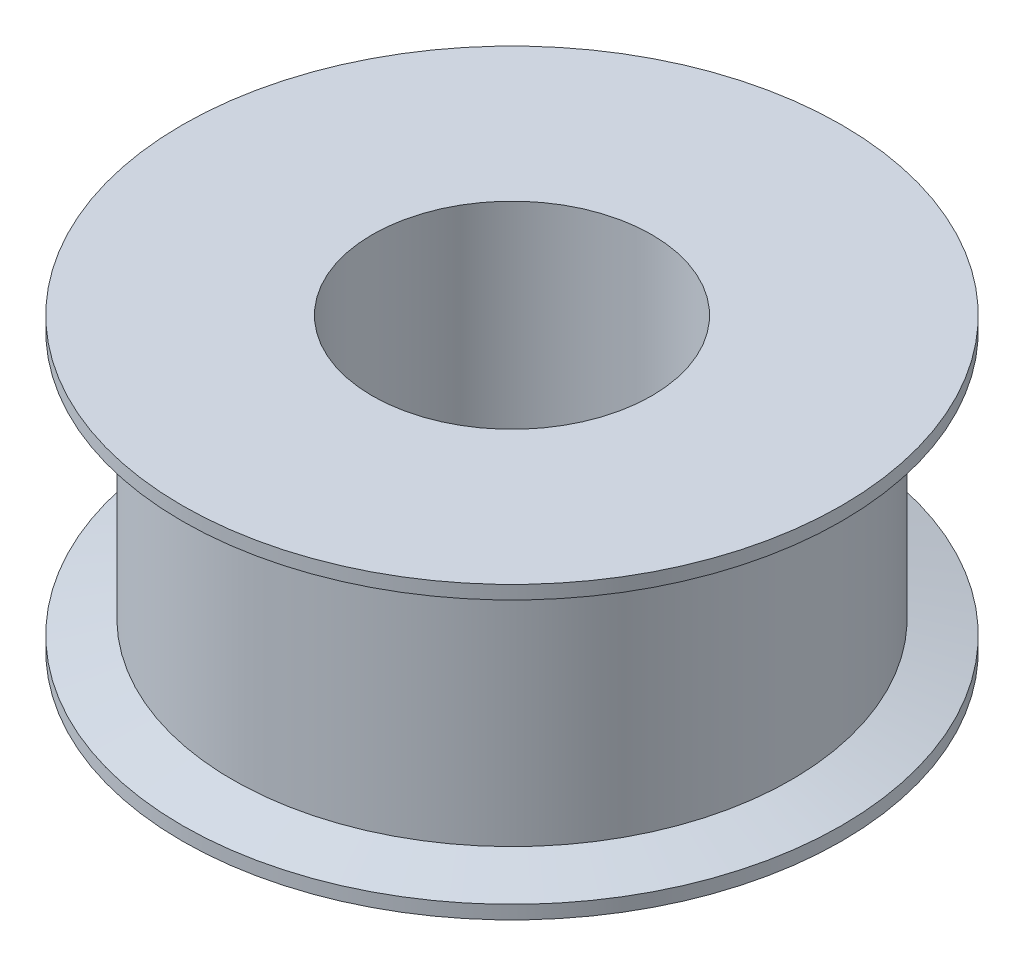
ISO-10303-21;
HEADER;
FILE_DESCRIPTION(('STEP AP214'),'2;1');
FILE_NAME('part.step','',(''),(''),'','','');
FILE_SCHEMA(('AUTOMOTIVE_DESIGN { 1 0 10303 214 1 1 1 1 }'));
ENDSEC;
DATA;
#1=APPLICATION_CONTEXT('core data for automotive mechanical design processes');
#2=APPLICATION_PROTOCOL_DEFINITION('international standard','automotive_design',2000,#1);
#3=PRODUCT_CONTEXT('',#1,'mechanical');
#4=PRODUCT('Part','Part','',(#3));
#5=PRODUCT_RELATED_PRODUCT_CATEGORY('part','',(#4));
#6=PRODUCT_DEFINITION_FORMATION('','',#4);
#7=PRODUCT_DEFINITION_CONTEXT('part definition',#1,'design');
#8=PRODUCT_DEFINITION('design','',#6,#7);
#9=PRODUCT_DEFINITION_SHAPE('','',#8);
#10=(LENGTH_UNIT() NAMED_UNIT(*) SI_UNIT(.MILLI.,.METRE.));
#11=(NAMED_UNIT(*) PLANE_ANGLE_UNIT() SI_UNIT($,.RADIAN.));
#12=(NAMED_UNIT(*) SI_UNIT($,.STERADIAN.) SOLID_ANGLE_UNIT());
#13=UNCERTAINTY_MEASURE_WITH_UNIT(LENGTH_MEASURE(1.E-05),#10,'distance_accuracy_value','');
#14=(GEOMETRIC_REPRESENTATION_CONTEXT(3) GLOBAL_UNCERTAINTY_ASSIGNED_CONTEXT((#13)) GLOBAL_UNIT_ASSIGNED_CONTEXT((#10,
#11,#12)) REPRESENTATION_CONTEXT('',''));
#15=CARTESIAN_POINT('',(0.,0.,0.));
#16=DIRECTION('',(0.,0.,1.));
#17=DIRECTION('',(1.,0.,0.));
#18=AXIS2_PLACEMENT_3D('',#15,#16,#17);
#19=CARTESIAN_POINT('',(6.35127,13.208,0.));
#20=DIRECTION('',(0.,1.,0.));
#21=DIRECTION('',(0.,0.,1.));
#22=AXIS2_PLACEMENT_3D('',#19,#20,#21);
#23=PLANE('',#22);
#24=CARTESIAN_POINT('',(0.,13.208,0.));
#25=DIRECTION('',(0.,-1.,0.));
#26=DIRECTION('',(0.,0.,-1.));
#27=AXIS2_PLACEMENT_3D('',#24,#25,#26);
#28=CIRCLE('',#27,6.35127);
#29=CARTESIAN_POINT('',(0.,13.208,-6.35127));
#30=VERTEX_POINT('',#29);
#31=EDGE_CURVE('E10',#30,#30,#28,.T.);
#32=ORIENTED_EDGE('',*,*,#31,.T.);
#33=EDGE_LOOP('',(#32));
#34=FACE_BOUND('',#33,.T.);
#35=CARTESIAN_POINT('',(0.,13.208,0.));
#36=DIRECTION('',(0.,-1.,0.));
#37=DIRECTION('',(0.,0.,-1.));
#38=AXIS2_PLACEMENT_3D('',#35,#36,#37);
#39=CIRCLE('',#38,14.986);
#40=CARTESIAN_POINT('',(0.,13.208,-14.986));
#41=VERTEX_POINT('',#40);
#42=EDGE_CURVE('E69',#41,#41,#39,.T.);
#43=ORIENTED_EDGE('',*,*,#42,.F.);
#44=EDGE_LOOP('',(#43));
#45=FACE_BOUND('',#44,.T.);
#46=ADVANCED_FACE('F34',(#34,#45),#23,.T.);
#47=CARTESIAN_POINT('',(0.,0.,0.));
#48=DIRECTION('',(0.,-1.,0.));
#49=DIRECTION('',(0.,0.,-1.));
#50=AXIS2_PLACEMENT_3D('',#47,#48,#49);
#51=CYLINDRICAL_SURFACE('',#50,6.35127);
#52=CARTESIAN_POINT('',(0.,0.,0.));
#53=DIRECTION('',(0.,-1.,0.));
#54=DIRECTION('',(0.,0.,-1.));
#55=AXIS2_PLACEMENT_3D('',#52,#53,#54);
#56=CIRCLE('',#55,6.35127);
#57=CARTESIAN_POINT('',(0.,0.,-6.35127));
#58=VERTEX_POINT('',#57);
#59=EDGE_CURVE('E41',#58,#58,#56,.T.);
#60=ORIENTED_EDGE('',*,*,#59,.T.);
#61=EDGE_LOOP('',(#60));
#62=FACE_BOUND('',#61,.T.);
#63=ORIENTED_EDGE('',*,*,#31,.F.);
#64=EDGE_LOOP('',(#63));
#65=FACE_BOUND('',#64,.T.);
#66=ADVANCED_FACE('F78',(#62,#65),#51,.F.);
#67=CARTESIAN_POINT('',(6.35127,0.,0.));
#68=DIRECTION('',(0.,-1.,0.));
#69=DIRECTION('',(0.,0.,-1.));
#70=AXIS2_PLACEMENT_3D('',#67,#68,#69);
#71=PLANE('',#70);
#72=CARTESIAN_POINT('',(0.,0.,0.));
#73=DIRECTION('',(0.,-1.,0.));
#74=DIRECTION('',(0.,0.,-1.));
#75=AXIS2_PLACEMENT_3D('',#72,#73,#74);
#76=CIRCLE('',#75,14.986);
#77=CARTESIAN_POINT('',(0.,0.,-14.986));
#78=VERTEX_POINT('',#77);
#79=EDGE_CURVE('E48',#78,#78,#76,.T.);
#80=ORIENTED_EDGE('',*,*,#79,.T.);
#81=EDGE_LOOP('',(#80));
#82=FACE_BOUND('',#81,.T.);
#83=ORIENTED_EDGE('',*,*,#59,.F.);
#84=EDGE_LOOP('',(#83));
#85=FACE_BOUND('',#84,.T.);
#86=ADVANCED_FACE('F82',(#82,#85),#71,.T.);
#87=CARTESIAN_POINT('',(0.,0.,0.));
#88=DIRECTION('',(0.,-1.,0.));
#89=DIRECTION('',(0.,0.,-1.));
#90=AXIS2_PLACEMENT_3D('',#87,#88,#89);
#91=CYLINDRICAL_SURFACE('',#90,14.986);
#92=CARTESIAN_POINT('',(0.,0.614500048155366,0.));
#93=DIRECTION('',(0.,-1.,0.));
#94=DIRECTION('',(0.,0.,-1.));
#95=AXIS2_PLACEMENT_3D('',#92,#93,#94);
#96=CIRCLE('',#95,14.986);
#97=CARTESIAN_POINT('',(0.,0.614500048155366,-14.986));
#98=VERTEX_POINT('',#97);
#99=EDGE_CURVE('E53',#98,#98,#96,.T.);
#100=ORIENTED_EDGE('',*,*,#99,.T.);
#101=EDGE_LOOP('',(#100));
#102=FACE_BOUND('',#101,.T.);
#103=ORIENTED_EDGE('',*,*,#79,.F.);
#104=EDGE_LOOP('',(#103));
#105=FACE_BOUND('',#104,.T.);
#106=ADVANCED_FACE('F86',(#102,#105),#91,.T.);
#107=CARTESIAN_POINT('',(0.,0.614500048155366,0.));
#108=DIRECTION('',(0.,-1.,0.));
#109=DIRECTION('',(0.,0.,-1.));
#110=AXIS2_PLACEMENT_3D('',#107,#108,#109);
#111=CONICAL_SURFACE('',#110,14.986,1.29154364647581);
#112=CARTESIAN_POINT('',(0.,1.27,0.));
#113=DIRECTION('',(0.,-1.,0.));
#114=DIRECTION('',(0.,0.,-1.));
#115=AXIS2_PLACEMENT_3D('',#112,#113,#114);
#116=CIRCLE('',#115,12.7);
#117=CARTESIAN_POINT('',(0.,1.27,-12.7));
#118=VERTEX_POINT('',#117);
#119=EDGE_CURVE('E59',#118,#118,#116,.T.);
#120=ORIENTED_EDGE('',*,*,#119,.T.);
#121=EDGE_LOOP('',(#120));
#122=FACE_BOUND('',#121,.T.);
#123=ORIENTED_EDGE('',*,*,#99,.F.);
#124=EDGE_LOOP('',(#123));
#125=FACE_BOUND('',#124,.T.);
#126=ADVANCED_FACE('F93',(#122,#125),#111,.T.);
#127=CARTESIAN_POINT('',(0.,0.,0.));
#128=DIRECTION('',(0.,-1.,0.));
#129=DIRECTION('',(0.,0.,-1.));
#130=AXIS2_PLACEMENT_3D('',#127,#128,#129);
#131=CYLINDRICAL_SURFACE('',#130,12.7);
#132=CARTESIAN_POINT('',(0.,11.938,0.));
#133=DIRECTION('',(0.,-1.,0.));
#134=DIRECTION('',(0.,0.,-1.));
#135=AXIS2_PLACEMENT_3D('',#132,#133,#134);
#136=CIRCLE('',#135,12.7);
#137=CARTESIAN_POINT('',(0.,11.938,-12.7));
#138=VERTEX_POINT('',#137);
#139=EDGE_CURVE('E63',#138,#138,#136,.T.);
#140=ORIENTED_EDGE('',*,*,#139,.T.);
#141=EDGE_LOOP('',(#140));
#142=FACE_BOUND('',#141,.T.);
#143=ORIENTED_EDGE('',*,*,#119,.F.);
#144=EDGE_LOOP('',(#143));
#145=FACE_BOUND('',#144,.T.);
#146=ADVANCED_FACE('F97',(#142,#145),#131,.T.);
#147=CARTESIAN_POINT('',(0.,11.938,0.));
#148=DIRECTION('',(0.,1.,0.));
#149=DIRECTION('',(0.,0.,1.));
#150=AXIS2_PLACEMENT_3D('',#147,#148,#149);
#151=CONICAL_SURFACE('',#150,12.7,1.2915436464758);
#152=CARTESIAN_POINT('',(0.,12.5934999518446,0.));
#153=DIRECTION('',(0.,-1.,0.));
#154=DIRECTION('',(0.,0.,-1.));
#155=AXIS2_PLACEMENT_3D('',#152,#153,#154);
#156=CIRCLE('',#155,14.986);
#157=CARTESIAN_POINT('',(0.,12.5934999518446,-14.986));
#158=VERTEX_POINT('',#157);
#159=EDGE_CURVE('E66',#158,#158,#156,.T.);
#160=ORIENTED_EDGE('',*,*,#159,.T.);
#161=EDGE_LOOP('',(#160));
#162=FACE_BOUND('',#161,.T.);
#163=ORIENTED_EDGE('',*,*,#139,.F.);
#164=EDGE_LOOP('',(#163));
#165=FACE_BOUND('',#164,.T.);
#166=ADVANCED_FACE('F101',(#162,#165),#151,.T.);
#167=CARTESIAN_POINT('',(0.,0.,0.));
#168=DIRECTION('',(0.,-1.,0.));
#169=DIRECTION('',(0.,0.,-1.));
#170=AXIS2_PLACEMENT_3D('',#167,#168,#169);
#171=CYLINDRICAL_SURFACE('',#170,14.986);
#172=ORIENTED_EDGE('',*,*,#42,.T.);
#173=EDGE_LOOP('',(#172));
#174=FACE_BOUND('',#173,.T.);
#175=ORIENTED_EDGE('',*,*,#159,.F.);
#176=EDGE_LOOP('',(#175));
#177=FACE_BOUND('',#176,.T.);
#178=ADVANCED_FACE('F74',(#174,#177),#171,.T.);
#179=CLOSED_SHELL('',(#46,#66,#86,#106,#126,#146,#166,#178));
#180=MANIFOLD_SOLID_BREP('B2',#179);
#181=ADVANCED_BREP_SHAPE_REPRESENTATION('',(#18,#180),#14);
#182=SHAPE_DEFINITION_REPRESENTATION(#9,#181);
ENDSEC;
END-ISO-10303-21;
